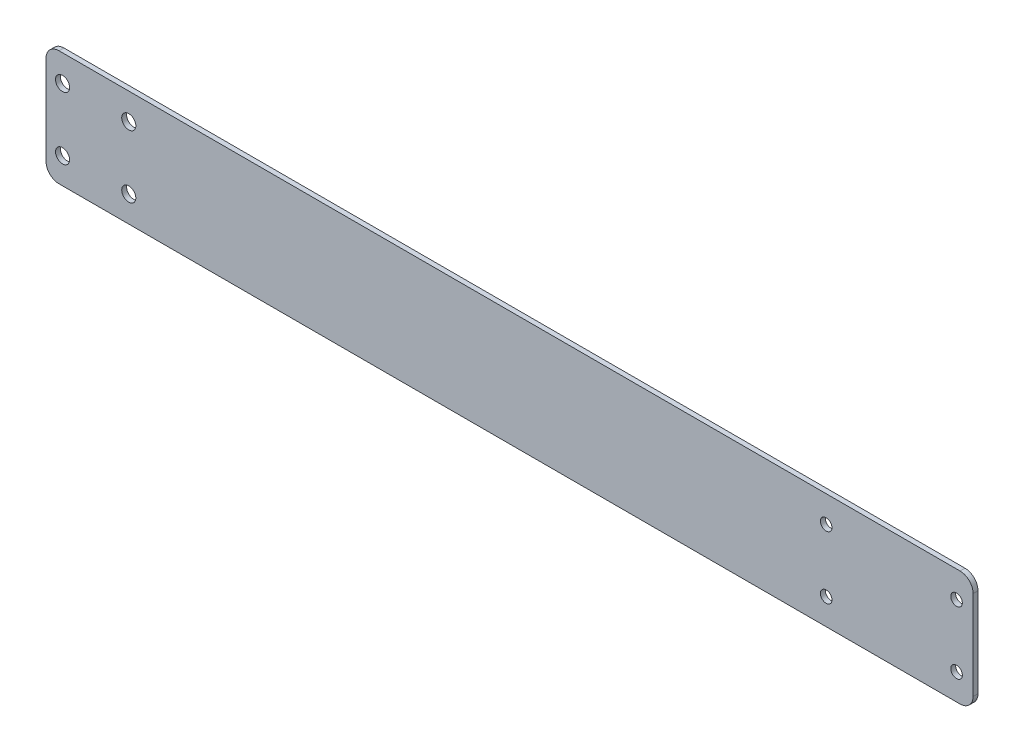
ISO-10303-21;
HEADER;
FILE_DESCRIPTION(('STEP AP214'),'2;1');
FILE_NAME('part.step','',(''),(''),'','','');
FILE_SCHEMA(('AUTOMOTIVE_DESIGN { 1 0 10303 214 1 1 1 1 }'));
ENDSEC;
DATA;
#1=APPLICATION_CONTEXT('core data for automotive mechanical design processes');
#2=APPLICATION_PROTOCOL_DEFINITION('international standard','automotive_design',2000,#1);
#3=PRODUCT_CONTEXT('',#1,'mechanical');
#4=PRODUCT('Part','Part','',(#3));
#5=PRODUCT_RELATED_PRODUCT_CATEGORY('part','',(#4));
#6=PRODUCT_DEFINITION_FORMATION('','',#4);
#7=PRODUCT_DEFINITION_CONTEXT('part definition',#1,'design');
#8=PRODUCT_DEFINITION('design','',#6,#7);
#9=PRODUCT_DEFINITION_SHAPE('','',#8);
#10=(LENGTH_UNIT() NAMED_UNIT(*) SI_UNIT(.MILLI.,.METRE.));
#11=(NAMED_UNIT(*) PLANE_ANGLE_UNIT() SI_UNIT($,.RADIAN.));
#12=(NAMED_UNIT(*) SI_UNIT($,.STERADIAN.) SOLID_ANGLE_UNIT());
#13=UNCERTAINTY_MEASURE_WITH_UNIT(LENGTH_MEASURE(1.E-05),#10,'distance_accuracy_value','');
#14=(GEOMETRIC_REPRESENTATION_CONTEXT(3) GLOBAL_UNCERTAINTY_ASSIGNED_CONTEXT((#13)) GLOBAL_UNIT_ASSIGNED_CONTEXT((#10,
#11,#12)) REPRESENTATION_CONTEXT('',''));
#15=CARTESIAN_POINT('',(0.,0.,0.));
#16=DIRECTION('',(0.,0.,1.));
#17=DIRECTION('',(1.,0.,0.));
#18=AXIS2_PLACEMENT_3D('',#15,#16,#17);
#19=CARTESIAN_POINT('',(0.,0.,-1.8796));
#20=DIRECTION('',(-1.,0.,0.));
#21=DIRECTION('',(0.,0.,1.));
#22=AXIS2_PLACEMENT_3D('',#19,#20,#21);
#23=PLANE('',#22);
#24=DIRECTION('',(0.,-1.,0.));
#25=VECTOR('',#24,1.);
#26=CARTESIAN_POINT('',(0.,0.,-1.8796));
#27=LINE('',#26,#25);
#28=CARTESIAN_POINT('',(0.,39.196,-1.8796));
#29=VERTEX_POINT('',#28);
#30=CARTESIAN_POINT('',(0.,5.,-1.8796));
#31=VERTEX_POINT('',#30);
#32=EDGE_CURVE('E170',#29,#31,#27,.T.);
#33=ORIENTED_EDGE('',*,*,#32,.T.);
#34=DIRECTION('',(0.,0.,1.));
#35=VECTOR('',#34,1.);
#36=CARTESIAN_POINT('',(0.,5.,-1.8796));
#37=LINE('',#36,#35);
#38=CARTESIAN_POINT('',(0.,5.,0.));
#39=VERTEX_POINT('',#38);
#40=EDGE_CURVE('E129',#31,#39,#37,.T.);
#41=ORIENTED_EDGE('',*,*,#40,.T.);
#42=DIRECTION('',(0.,-1.,0.));
#43=VECTOR('',#42,1.);
#44=CARTESIAN_POINT('',(0.,0.,0.));
#45=LINE('',#44,#43);
#46=CARTESIAN_POINT('',(0.,39.196,0.));
#47=VERTEX_POINT('',#46);
#48=EDGE_CURVE('E113',#47,#39,#45,.T.);
#49=ORIENTED_EDGE('',*,*,#48,.F.);
#50=DIRECTION('',(0.,0.,1.));
#51=VECTOR('',#50,1.);
#52=CARTESIAN_POINT('',(0.,39.196,-1.8796));
#53=LINE('',#52,#51);
#54=EDGE_CURVE('E126',#47,#29,#53,.F.);
#55=ORIENTED_EDGE('',*,*,#54,.T.);
#56=EDGE_LOOP('',(#33,#41,#49,#55));
#57=FACE_BOUND('',#56,.T.);
#58=ADVANCED_FACE('F45',(#57),#23,.T.);
#59=CARTESIAN_POINT('',(0.,44.196,-1.8796));
#60=DIRECTION('',(0.,1.,0.));
#61=DIRECTION('',(0.,0.,1.));
#62=AXIS2_PLACEMENT_3D('',#59,#60,#61);
#63=PLANE('',#62);
#64=DIRECTION('',(-1.,0.,0.));
#65=VECTOR('',#64,1.);
#66=CARTESIAN_POINT('',(0.,44.196,-1.8796));
#67=LINE('',#66,#65);
#68=CARTESIAN_POINT('',(350.6,44.196,-1.8796));
#69=VERTEX_POINT('',#68);
#70=CARTESIAN_POINT('',(5.,44.196,-1.8796));
#71=VERTEX_POINT('',#70);
#72=EDGE_CURVE('E136',#69,#71,#67,.T.);
#73=ORIENTED_EDGE('',*,*,#72,.T.);
#74=DIRECTION('',(0.,0.,1.));
#75=VECTOR('',#74,1.);
#76=CARTESIAN_POINT('',(5.,44.196,-1.8796));
#77=LINE('',#76,#75);
#78=CARTESIAN_POINT('',(5.,44.196,0.));
#79=VERTEX_POINT('',#78);
#80=EDGE_CURVE('E162',#71,#79,#77,.T.);
#81=ORIENTED_EDGE('',*,*,#80,.T.);
#82=DIRECTION('',(-1.,0.,0.));
#83=VECTOR('',#82,1.);
#84=CARTESIAN_POINT('',(0.,44.196,0.));
#85=LINE('',#84,#83);
#86=CARTESIAN_POINT('',(350.6,44.196,0.));
#87=VERTEX_POINT('',#86);
#88=EDGE_CURVE('E115',#87,#79,#85,.T.);
#89=ORIENTED_EDGE('',*,*,#88,.F.);
#90=DIRECTION('',(0.,0.,1.));
#91=VECTOR('',#90,1.);
#92=CARTESIAN_POINT('',(350.6,44.196,-1.8796));
#93=LINE('',#92,#91);
#94=EDGE_CURVE('E160',#87,#69,#93,.F.);
#95=ORIENTED_EDGE('',*,*,#94,.T.);
#96=EDGE_LOOP('',(#73,#81,#89,#95));
#97=FACE_BOUND('',#96,.T.);
#98=ADVANCED_FACE('F268',(#97),#63,.T.);
#99=CARTESIAN_POINT('',(355.6,0.,-1.8796));
#100=DIRECTION('',(1.,0.,0.));
#101=DIRECTION('',(0.,0.,-1.));
#102=AXIS2_PLACEMENT_3D('',#99,#100,#101);
#103=PLANE('',#102);
#104=DIRECTION('',(0.,1.,0.));
#105=VECTOR('',#104,1.);
#106=CARTESIAN_POINT('',(355.6,0.,0.));
#107=LINE('',#106,#105);
#108=CARTESIAN_POINT('',(355.6,5.,0.));
#109=VERTEX_POINT('',#108);
#110=CARTESIAN_POINT('',(355.6,39.196,0.));
#111=VERTEX_POINT('',#110);
#112=EDGE_CURVE('E167',#109,#111,#107,.T.);
#113=ORIENTED_EDGE('',*,*,#112,.F.);
#114=DIRECTION('',(0.,0.,1.));
#115=VECTOR('',#114,1.);
#116=CARTESIAN_POINT('',(355.6,5.,-1.8796));
#117=LINE('',#116,#115);
#118=CARTESIAN_POINT('',(355.6,5.,-1.8796));
#119=VERTEX_POINT('',#118);
#120=EDGE_CURVE('E11',#109,#119,#117,.F.);
#121=ORIENTED_EDGE('',*,*,#120,.T.);
#122=DIRECTION('',(0.,1.,0.));
#123=VECTOR('',#122,1.);
#124=CARTESIAN_POINT('',(355.6,0.,-1.8796));
#125=LINE('',#124,#123);
#126=CARTESIAN_POINT('',(355.6,39.196,-1.8796));
#127=VERTEX_POINT('',#126);
#128=EDGE_CURVE('E141',#119,#127,#125,.T.);
#129=ORIENTED_EDGE('',*,*,#128,.T.);
#130=DIRECTION('',(0.,0.,1.));
#131=VECTOR('',#130,1.);
#132=CARTESIAN_POINT('',(355.6,39.196,-1.8796));
#133=LINE('',#132,#131);
#134=EDGE_CURVE('E53',#127,#111,#133,.T.);
#135=ORIENTED_EDGE('',*,*,#134,.T.);
#136=EDGE_LOOP('',(#113,#121,#129,#135));
#137=FACE_BOUND('',#136,.T.);
#138=ADVANCED_FACE('F166',(#137),#103,.T.);
#139=CARTESIAN_POINT('',(0.,0.,-1.8796));
#140=DIRECTION('',(0.,-1.,0.));
#141=DIRECTION('',(0.,0.,-1.));
#142=AXIS2_PLACEMENT_3D('',#139,#140,#141);
#143=PLANE('',#142);
#144=DIRECTION('',(1.,0.,0.));
#145=VECTOR('',#144,1.);
#146=CARTESIAN_POINT('',(0.,0.,0.));
#147=LINE('',#146,#145);
#148=CARTESIAN_POINT('',(5.,0.,0.));
#149=VERTEX_POINT('',#148);
#150=CARTESIAN_POINT('',(350.6,0.,0.));
#151=VERTEX_POINT('',#150);
#152=EDGE_CURVE('E130',#149,#151,#147,.T.);
#153=ORIENTED_EDGE('',*,*,#152,.F.);
#154=DIRECTION('',(0.,0.,1.));
#155=VECTOR('',#154,1.);
#156=CARTESIAN_POINT('',(5.,0.,-1.8796));
#157=LINE('',#156,#155);
#158=CARTESIAN_POINT('',(5.,0.,-1.8796));
#159=VERTEX_POINT('',#158);
#160=EDGE_CURVE('E152',#149,#159,#157,.F.);
#161=ORIENTED_EDGE('',*,*,#160,.T.);
#162=DIRECTION('',(1.,0.,0.));
#163=VECTOR('',#162,1.);
#164=CARTESIAN_POINT('',(0.,0.,-1.8796));
#165=LINE('',#164,#163);
#166=CARTESIAN_POINT('',(350.6,0.,-1.8796));
#167=VERTEX_POINT('',#166);
#168=EDGE_CURVE('E174',#159,#167,#165,.T.);
#169=ORIENTED_EDGE('',*,*,#168,.T.);
#170=DIRECTION('',(0.,0.,1.));
#171=VECTOR('',#170,1.);
#172=CARTESIAN_POINT('',(350.6,0.,-1.8796));
#173=LINE('',#172,#171);
#174=EDGE_CURVE('E149',#167,#151,#173,.T.);
#175=ORIENTED_EDGE('',*,*,#174,.T.);
#176=EDGE_LOOP('',(#153,#161,#169,#175));
#177=FACE_BOUND('',#176,.T.);
#178=ADVANCED_FACE('F277',(#177),#143,.T.);
#179=CARTESIAN_POINT('',(0.,0.,-1.8796));
#180=DIRECTION('',(0.,0.,-1.));
#181=DIRECTION('',(-1.,0.,0.));
#182=AXIS2_PLACEMENT_3D('',#179,#180,#181);
#183=PLANE('',#182);
#184=CARTESIAN_POINT('',(31.75,9.99999999999997,-1.8796));
#185=DIRECTION('',(0.,0.,1.));
#186=DIRECTION('',(1.,0.,0.));
#187=AXIS2_PLACEMENT_3D('',#184,#185,#186);
#188=CIRCLE('',#187,2.7051);
#189=CARTESIAN_POINT('',(34.4551,9.99999999999997,-1.8796));
#190=VERTEX_POINT('',#189);
#191=EDGE_CURVE('E217',#190,#190,#188,.T.);
#192=ORIENTED_EDGE('',*,*,#191,.T.);
#193=EDGE_LOOP('',(#192));
#194=FACE_BOUND('',#193,.T.);
#195=CARTESIAN_POINT('',(6.35000000000003,9.99999999999996,-1.8796));
#196=DIRECTION('',(0.,0.,1.));
#197=DIRECTION('',(1.,0.,0.));
#198=AXIS2_PLACEMENT_3D('',#195,#196,#197);
#199=CIRCLE('',#198,2.7051);
#200=CARTESIAN_POINT('',(9.05510000000003,9.99999999999996,-1.8796));
#201=VERTEX_POINT('',#200);
#202=EDGE_CURVE('E211',#201,#201,#199,.T.);
#203=ORIENTED_EDGE('',*,*,#202,.T.);
#204=EDGE_LOOP('',(#203));
#205=FACE_BOUND('',#204,.T.);
#206=CARTESIAN_POINT('',(31.75,34.,-1.8796));
#207=DIRECTION('',(0.,0.,1.));
#208=DIRECTION('',(1.,0.,0.));
#209=AXIS2_PLACEMENT_3D('',#206,#207,#208);
#210=CIRCLE('',#209,2.7051);
#211=CARTESIAN_POINT('',(34.4551,34.,-1.8796));
#212=VERTEX_POINT('',#211);
#213=EDGE_CURVE('E205',#212,#212,#210,.T.);
#214=ORIENTED_EDGE('',*,*,#213,.T.);
#215=EDGE_LOOP('',(#214));
#216=FACE_BOUND('',#215,.T.);
#217=CARTESIAN_POINT('',(6.35000000000002,34.,-1.8796));
#218=DIRECTION('',(0.,0.,1.));
#219=DIRECTION('',(1.,0.,0.));
#220=AXIS2_PLACEMENT_3D('',#217,#218,#219);
#221=CIRCLE('',#220,2.7051);
#222=CARTESIAN_POINT('',(9.05510000000002,34.,-1.8796));
#223=VERTEX_POINT('',#222);
#224=EDGE_CURVE('E199',#223,#223,#221,.T.);
#225=ORIENTED_EDGE('',*,*,#224,.T.);
#226=EDGE_LOOP('',(#225));
#227=FACE_BOUND('',#226,.T.);
#228=CARTESIAN_POINT('',(299.25,34.,-1.8796));
#229=DIRECTION('',(0.,0.,1.));
#230=DIRECTION('',(1.,0.,0.));
#231=AXIS2_PLACEMENT_3D('',#228,#229,#230);
#232=CIRCLE('',#231,2.2225);
#233=CARTESIAN_POINT('',(301.4725,34.,-1.8796));
#234=VERTEX_POINT('',#233);
#235=EDGE_CURVE('E193',#234,#234,#232,.T.);
#236=ORIENTED_EDGE('',*,*,#235,.T.);
#237=EDGE_LOOP('',(#236));
#238=FACE_BOUND('',#237,.T.);
#239=CARTESIAN_POINT('',(349.25,34.,-1.8796));
#240=DIRECTION('',(0.,0.,1.));
#241=DIRECTION('',(1.,0.,0.));
#242=AXIS2_PLACEMENT_3D('',#239,#240,#241);
#243=CIRCLE('',#242,2.2225);
#244=CARTESIAN_POINT('',(351.4725,34.,-1.8796));
#245=VERTEX_POINT('',#244);
#246=EDGE_CURVE('E187',#245,#245,#243,.T.);
#247=ORIENTED_EDGE('',*,*,#246,.T.);
#248=EDGE_LOOP('',(#247));
#249=FACE_BOUND('',#248,.T.);
#250=CARTESIAN_POINT('',(349.25,10.,-1.8796));
#251=DIRECTION('',(0.,0.,1.));
#252=DIRECTION('',(1.,0.,0.));
#253=AXIS2_PLACEMENT_3D('',#250,#251,#252);
#254=CIRCLE('',#253,2.2225);
#255=CARTESIAN_POINT('',(351.4725,10.,-1.8796));
#256=VERTEX_POINT('',#255);
#257=EDGE_CURVE('E181',#256,#256,#254,.T.);
#258=ORIENTED_EDGE('',*,*,#257,.T.);
#259=EDGE_LOOP('',(#258));
#260=FACE_BOUND('',#259,.T.);
#261=CARTESIAN_POINT('',(299.25,10.,-1.8796));
#262=DIRECTION('',(0.,0.,1.));
#263=DIRECTION('',(1.,0.,0.));
#264=AXIS2_PLACEMENT_3D('',#261,#262,#263);
#265=CIRCLE('',#264,2.2225);
#266=CARTESIAN_POINT('',(301.4725,10.,-1.8796));
#267=VERTEX_POINT('',#266);
#268=EDGE_CURVE('E131',#267,#267,#265,.T.);
#269=ORIENTED_EDGE('',*,*,#268,.T.);
#270=EDGE_LOOP('',(#269));
#271=FACE_BOUND('',#270,.T.);
#272=ORIENTED_EDGE('',*,*,#168,.F.);
#273=CARTESIAN_POINT('',(5.,5.,-1.8796));
#274=DIRECTION('',(0.,0.,-1.));
#275=DIRECTION('',(-1.,0.,0.));
#276=AXIS2_PLACEMENT_3D('',#273,#274,#275);
#277=CIRCLE('',#276,5.);
#278=EDGE_CURVE('E158',#159,#31,#277,.T.);
#279=ORIENTED_EDGE('',*,*,#278,.T.);
#280=ORIENTED_EDGE('',*,*,#32,.F.);
#281=CARTESIAN_POINT('',(5.,39.196,-1.8796));
#282=DIRECTION('',(0.,0.,-1.));
#283=DIRECTION('',(-1.,0.,0.));
#284=AXIS2_PLACEMENT_3D('',#281,#282,#283);
#285=CIRCLE('',#284,5.);
#286=EDGE_CURVE('E135',#29,#71,#285,.T.);
#287=ORIENTED_EDGE('',*,*,#286,.T.);
#288=ORIENTED_EDGE('',*,*,#72,.F.);
#289=CARTESIAN_POINT('',(350.6,39.196,-1.8796));
#290=DIRECTION('',(0.,0.,-1.));
#291=DIRECTION('',(-1.,0.,0.));
#292=AXIS2_PLACEMENT_3D('',#289,#290,#291);
#293=CIRCLE('',#292,5.);
#294=EDGE_CURVE('E60',#69,#127,#293,.T.);
#295=ORIENTED_EDGE('',*,*,#294,.T.);
#296=ORIENTED_EDGE('',*,*,#128,.F.);
#297=CARTESIAN_POINT('',(350.6,5.,-1.8796));
#298=DIRECTION('',(0.,0.,-1.));
#299=DIRECTION('',(-1.,0.,0.));
#300=AXIS2_PLACEMENT_3D('',#297,#298,#299);
#301=CIRCLE('',#300,5.);
#302=EDGE_CURVE('E155',#119,#167,#301,.T.);
#303=ORIENTED_EDGE('',*,*,#302,.T.);
#304=EDGE_LOOP('',(#272,#279,#280,#287,#288,#295,#296,#303));
#305=FACE_BOUND('',#304,.T.);
#306=ADVANCED_FACE('F226',(#194,#205,#216,#227,#238,#249,#260,#271,#305),#183,.T.);
#307=CARTESIAN_POINT('',(0.,0.,0.));
#308=DIRECTION('',(0.,0.,-1.));
#309=DIRECTION('',(-1.,0.,0.));
#310=AXIS2_PLACEMENT_3D('',#307,#308,#309);
#311=PLANE('',#310);
#312=CARTESIAN_POINT('',(31.75,9.99999999999997,0.));
#313=DIRECTION('',(0.,0.,1.));
#314=DIRECTION('',(1.,0.,0.));
#315=AXIS2_PLACEMENT_3D('',#312,#313,#314);
#316=CIRCLE('',#315,2.7051);
#317=CARTESIAN_POINT('',(34.4551,9.99999999999997,0.));
#318=VERTEX_POINT('',#317);
#319=EDGE_CURVE('E220',#318,#318,#316,.T.);
#320=ORIENTED_EDGE('',*,*,#319,.F.);
#321=EDGE_LOOP('',(#320));
#322=FACE_BOUND('',#321,.T.);
#323=CARTESIAN_POINT('',(6.35000000000003,9.99999999999996,0.));
#324=DIRECTION('',(0.,0.,1.));
#325=DIRECTION('',(1.,0.,0.));
#326=AXIS2_PLACEMENT_3D('',#323,#324,#325);
#327=CIRCLE('',#326,2.7051);
#328=CARTESIAN_POINT('',(9.05510000000003,9.99999999999996,0.));
#329=VERTEX_POINT('',#328);
#330=EDGE_CURVE('E214',#329,#329,#327,.T.);
#331=ORIENTED_EDGE('',*,*,#330,.F.);
#332=EDGE_LOOP('',(#331));
#333=FACE_BOUND('',#332,.T.);
#334=CARTESIAN_POINT('',(31.75,34.,0.));
#335=DIRECTION('',(0.,0.,1.));
#336=DIRECTION('',(1.,0.,0.));
#337=AXIS2_PLACEMENT_3D('',#334,#335,#336);
#338=CIRCLE('',#337,2.7051);
#339=CARTESIAN_POINT('',(34.4551,34.,0.));
#340=VERTEX_POINT('',#339);
#341=EDGE_CURVE('E208',#340,#340,#338,.T.);
#342=ORIENTED_EDGE('',*,*,#341,.F.);
#343=EDGE_LOOP('',(#342));
#344=FACE_BOUND('',#343,.T.);
#345=CARTESIAN_POINT('',(6.35000000000002,34.,0.));
#346=DIRECTION('',(0.,0.,1.));
#347=DIRECTION('',(1.,0.,0.));
#348=AXIS2_PLACEMENT_3D('',#345,#346,#347);
#349=CIRCLE('',#348,2.7051);
#350=CARTESIAN_POINT('',(9.05510000000002,34.,0.));
#351=VERTEX_POINT('',#350);
#352=EDGE_CURVE('E202',#351,#351,#349,.T.);
#353=ORIENTED_EDGE('',*,*,#352,.F.);
#354=EDGE_LOOP('',(#353));
#355=FACE_BOUND('',#354,.T.);
#356=CARTESIAN_POINT('',(299.25,34.,0.));
#357=DIRECTION('',(0.,0.,1.));
#358=DIRECTION('',(1.,0.,0.));
#359=AXIS2_PLACEMENT_3D('',#356,#357,#358);
#360=CIRCLE('',#359,2.2225);
#361=CARTESIAN_POINT('',(301.4725,34.,0.));
#362=VERTEX_POINT('',#361);
#363=EDGE_CURVE('E196',#362,#362,#360,.T.);
#364=ORIENTED_EDGE('',*,*,#363,.F.);
#365=EDGE_LOOP('',(#364));
#366=FACE_BOUND('',#365,.T.);
#367=CARTESIAN_POINT('',(349.25,34.,0.));
#368=DIRECTION('',(0.,0.,1.));
#369=DIRECTION('',(1.,0.,0.));
#370=AXIS2_PLACEMENT_3D('',#367,#368,#369);
#371=CIRCLE('',#370,2.2225);
#372=CARTESIAN_POINT('',(351.4725,34.,0.));
#373=VERTEX_POINT('',#372);
#374=EDGE_CURVE('E190',#373,#373,#371,.T.);
#375=ORIENTED_EDGE('',*,*,#374,.F.);
#376=EDGE_LOOP('',(#375));
#377=FACE_BOUND('',#376,.T.);
#378=CARTESIAN_POINT('',(349.25,10.,0.));
#379=DIRECTION('',(0.,0.,1.));
#380=DIRECTION('',(1.,0.,0.));
#381=AXIS2_PLACEMENT_3D('',#378,#379,#380);
#382=CIRCLE('',#381,2.2225);
#383=CARTESIAN_POINT('',(351.4725,10.,0.));
#384=VERTEX_POINT('',#383);
#385=EDGE_CURVE('E184',#384,#384,#382,.T.);
#386=ORIENTED_EDGE('',*,*,#385,.F.);
#387=EDGE_LOOP('',(#386));
#388=FACE_BOUND('',#387,.T.);
#389=CARTESIAN_POINT('',(299.25,10.,0.));
#390=DIRECTION('',(0.,0.,1.));
#391=DIRECTION('',(1.,0.,0.));
#392=AXIS2_PLACEMENT_3D('',#389,#390,#391);
#393=CIRCLE('',#392,2.2225);
#394=CARTESIAN_POINT('',(301.4725,10.,0.));
#395=VERTEX_POINT('',#394);
#396=EDGE_CURVE('E178',#395,#395,#393,.T.);
#397=ORIENTED_EDGE('',*,*,#396,.F.);
#398=EDGE_LOOP('',(#397));
#399=FACE_BOUND('',#398,.T.);
#400=ORIENTED_EDGE('',*,*,#48,.T.);
#401=CARTESIAN_POINT('',(5.,5.,0.));
#402=DIRECTION('',(0.,0.,-1.));
#403=DIRECTION('',(-1.,0.,0.));
#404=AXIS2_PLACEMENT_3D('',#401,#402,#403);
#405=CIRCLE('',#404,5.);
#406=EDGE_CURVE('E120',#39,#149,#405,.F.);
#407=ORIENTED_EDGE('',*,*,#406,.T.);
#408=ORIENTED_EDGE('',*,*,#152,.T.);
#409=CARTESIAN_POINT('',(350.6,5.,0.));
#410=DIRECTION('',(0.,0.,-1.));
#411=DIRECTION('',(-1.,0.,0.));
#412=AXIS2_PLACEMENT_3D('',#409,#410,#411);
#413=CIRCLE('',#412,5.);
#414=EDGE_CURVE('E121',#151,#109,#413,.F.);
#415=ORIENTED_EDGE('',*,*,#414,.T.);
#416=ORIENTED_EDGE('',*,*,#112,.T.);
#417=CARTESIAN_POINT('',(350.6,39.196,0.));
#418=DIRECTION('',(0.,0.,-1.));
#419=DIRECTION('',(-1.,0.,0.));
#420=AXIS2_PLACEMENT_3D('',#417,#418,#419);
#421=CIRCLE('',#420,5.);
#422=EDGE_CURVE('E138',#111,#87,#421,.F.);
#423=ORIENTED_EDGE('',*,*,#422,.T.);
#424=ORIENTED_EDGE('',*,*,#88,.T.);
#425=CARTESIAN_POINT('',(5.,39.196,0.));
#426=DIRECTION('',(0.,0.,-1.));
#427=DIRECTION('',(-1.,0.,0.));
#428=AXIS2_PLACEMENT_3D('',#425,#426,#427);
#429=CIRCLE('',#428,5.);
#430=EDGE_CURVE('E110',#79,#47,#429,.F.);
#431=ORIENTED_EDGE('',*,*,#430,.T.);
#432=EDGE_LOOP('',(#400,#407,#408,#415,#416,#423,#424,#431));
#433=FACE_BOUND('',#432,.T.);
#434=ADVANCED_FACE('F112',(#322,#333,#344,#355,#366,#377,#388,#399,#433),#311,.F.);
#435=CARTESIAN_POINT('',(299.25,10.,-1.8796));
#436=DIRECTION('',(0.,0.,1.));
#437=DIRECTION('',(1.,0.,0.));
#438=AXIS2_PLACEMENT_3D('',#435,#436,#437);
#439=CYLINDRICAL_SURFACE('',#438,2.2225);
#440=ORIENTED_EDGE('',*,*,#268,.F.);
#441=EDGE_LOOP('',(#440));
#442=FACE_BOUND('',#441,.T.);
#443=ORIENTED_EDGE('',*,*,#396,.T.);
#444=EDGE_LOOP('',(#443));
#445=FACE_BOUND('',#444,.T.);
#446=ADVANCED_FACE('F239',(#442,#445),#439,.F.);
#447=CARTESIAN_POINT('',(349.25,10.,-1.8796));
#448=DIRECTION('',(0.,0.,1.));
#449=DIRECTION('',(1.,0.,0.));
#450=AXIS2_PLACEMENT_3D('',#447,#448,#449);
#451=CYLINDRICAL_SURFACE('',#450,2.2225);
#452=ORIENTED_EDGE('',*,*,#257,.F.);
#453=EDGE_LOOP('',(#452));
#454=FACE_BOUND('',#453,.T.);
#455=ORIENTED_EDGE('',*,*,#385,.T.);
#456=EDGE_LOOP('',(#455));
#457=FACE_BOUND('',#456,.T.);
#458=ADVANCED_FACE('F256',(#454,#457),#451,.F.);
#459=CARTESIAN_POINT('',(349.25,34.,-1.8796));
#460=DIRECTION('',(0.,0.,1.));
#461=DIRECTION('',(1.,0.,0.));
#462=AXIS2_PLACEMENT_3D('',#459,#460,#461);
#463=CYLINDRICAL_SURFACE('',#462,2.2225);
#464=ORIENTED_EDGE('',*,*,#246,.F.);
#465=EDGE_LOOP('',(#464));
#466=FACE_BOUND('',#465,.T.);
#467=ORIENTED_EDGE('',*,*,#374,.T.);
#468=EDGE_LOOP('',(#467));
#469=FACE_BOUND('',#468,.T.);
#470=ADVANCED_FACE('F262',(#466,#469),#463,.F.);
#471=CARTESIAN_POINT('',(299.25,34.,-1.8796));
#472=DIRECTION('',(0.,0.,1.));
#473=DIRECTION('',(1.,0.,0.));
#474=AXIS2_PLACEMENT_3D('',#471,#472,#473);
#475=CYLINDRICAL_SURFACE('',#474,2.2225);
#476=ORIENTED_EDGE('',*,*,#235,.F.);
#477=EDGE_LOOP('',(#476));
#478=FACE_BOUND('',#477,.T.);
#479=ORIENTED_EDGE('',*,*,#363,.T.);
#480=EDGE_LOOP('',(#479));
#481=FACE_BOUND('',#480,.T.);
#482=ADVANCED_FACE('F353',(#478,#481),#475,.F.);
#483=CARTESIAN_POINT('',(6.35000000000002,34.,-1.8796));
#484=DIRECTION('',(0.,0.,1.));
#485=DIRECTION('',(1.,0.,0.));
#486=AXIS2_PLACEMENT_3D('',#483,#484,#485);
#487=CYLINDRICAL_SURFACE('',#486,2.7051);
#488=ORIENTED_EDGE('',*,*,#224,.F.);
#489=EDGE_LOOP('',(#488));
#490=FACE_BOUND('',#489,.T.);
#491=ORIENTED_EDGE('',*,*,#352,.T.);
#492=EDGE_LOOP('',(#491));
#493=FACE_BOUND('',#492,.T.);
#494=ADVANCED_FACE('F342',(#490,#493),#487,.F.);
#495=CARTESIAN_POINT('',(31.75,34.,-1.8796));
#496=DIRECTION('',(0.,0.,1.));
#497=DIRECTION('',(1.,0.,0.));
#498=AXIS2_PLACEMENT_3D('',#495,#496,#497);
#499=CYLINDRICAL_SURFACE('',#498,2.7051);
#500=ORIENTED_EDGE('',*,*,#213,.F.);
#501=EDGE_LOOP('',(#500));
#502=FACE_BOUND('',#501,.T.);
#503=ORIENTED_EDGE('',*,*,#341,.T.);
#504=EDGE_LOOP('',(#503));
#505=FACE_BOUND('',#504,.T.);
#506=ADVANCED_FACE('F331',(#502,#505),#499,.F.);
#507=CARTESIAN_POINT('',(6.35000000000003,9.99999999999996,-1.8796));
#508=DIRECTION('',(0.,0.,1.));
#509=DIRECTION('',(1.,0.,0.));
#510=AXIS2_PLACEMENT_3D('',#507,#508,#509);
#511=CYLINDRICAL_SURFACE('',#510,2.7051);
#512=ORIENTED_EDGE('',*,*,#202,.F.);
#513=EDGE_LOOP('',(#512));
#514=FACE_BOUND('',#513,.T.);
#515=ORIENTED_EDGE('',*,*,#330,.T.);
#516=EDGE_LOOP('',(#515));
#517=FACE_BOUND('',#516,.T.);
#518=ADVANCED_FACE('F233',(#514,#517),#511,.F.);
#519=CARTESIAN_POINT('',(31.75,9.99999999999997,-1.8796));
#520=DIRECTION('',(0.,0.,1.));
#521=DIRECTION('',(1.,0.,0.));
#522=AXIS2_PLACEMENT_3D('',#519,#520,#521);
#523=CYLINDRICAL_SURFACE('',#522,2.7051);
#524=ORIENTED_EDGE('',*,*,#191,.F.);
#525=EDGE_LOOP('',(#524));
#526=FACE_BOUND('',#525,.T.);
#527=ORIENTED_EDGE('',*,*,#319,.T.);
#528=EDGE_LOOP('',(#527));
#529=FACE_BOUND('',#528,.T.);
#530=ADVANCED_FACE('F229',(#526,#529),#523,.F.);
#531=CARTESIAN_POINT('',(5.,5.,-1.8796));
#532=DIRECTION('',(0.,0.,1.));
#533=DIRECTION('',(1.,0.,0.));
#534=AXIS2_PLACEMENT_3D('',#531,#532,#533);
#535=CYLINDRICAL_SURFACE('',#534,5.);
#536=ORIENTED_EDGE('',*,*,#278,.F.);
#537=ORIENTED_EDGE('',*,*,#160,.F.);
#538=ORIENTED_EDGE('',*,*,#406,.F.);
#539=ORIENTED_EDGE('',*,*,#40,.F.);
#540=EDGE_LOOP('',(#536,#537,#538,#539));
#541=FACE_BOUND('',#540,.T.);
#542=ADVANCED_FACE('F232',(#541),#535,.T.);
#543=CARTESIAN_POINT('',(5.,39.196,-1.8796));
#544=DIRECTION('',(0.,0.,1.));
#545=DIRECTION('',(1.,0.,0.));
#546=AXIS2_PLACEMENT_3D('',#543,#544,#545);
#547=CYLINDRICAL_SURFACE('',#546,5.);
#548=ORIENTED_EDGE('',*,*,#286,.F.);
#549=ORIENTED_EDGE('',*,*,#54,.F.);
#550=ORIENTED_EDGE('',*,*,#430,.F.);
#551=ORIENTED_EDGE('',*,*,#80,.F.);
#552=EDGE_LOOP('',(#548,#549,#550,#551));
#553=FACE_BOUND('',#552,.T.);
#554=ADVANCED_FACE('F134',(#553),#547,.T.);
#555=CARTESIAN_POINT('',(350.6,5.,-1.8796));
#556=DIRECTION('',(0.,0.,1.));
#557=DIRECTION('',(1.,0.,0.));
#558=AXIS2_PLACEMENT_3D('',#555,#556,#557);
#559=CYLINDRICAL_SURFACE('',#558,5.);
#560=ORIENTED_EDGE('',*,*,#302,.F.);
#561=ORIENTED_EDGE('',*,*,#120,.F.);
#562=ORIENTED_EDGE('',*,*,#414,.F.);
#563=ORIENTED_EDGE('',*,*,#174,.F.);
#564=EDGE_LOOP('',(#560,#561,#562,#563));
#565=FACE_BOUND('',#564,.T.);
#566=ADVANCED_FACE('F283',(#565),#559,.T.);
#567=CARTESIAN_POINT('',(350.6,39.196,-1.8796));
#568=DIRECTION('',(0.,0.,1.));
#569=DIRECTION('',(1.,0.,0.));
#570=AXIS2_PLACEMENT_3D('',#567,#568,#569);
#571=CYLINDRICAL_SURFACE('',#570,5.);
#572=ORIENTED_EDGE('',*,*,#294,.F.);
#573=ORIENTED_EDGE('',*,*,#94,.F.);
#574=ORIENTED_EDGE('',*,*,#422,.F.);
#575=ORIENTED_EDGE('',*,*,#134,.F.);
#576=EDGE_LOOP('',(#572,#573,#574,#575));
#577=FACE_BOUND('',#576,.T.);
#578=ADVANCED_FACE('F47',(#577),#571,.T.);
#579=CLOSED_SHELL('',(#58,#98,#138,#178,#306,#434,#446,#458,#470,#482,#494,#506,#518,#530,#542,
#554,#566,#578));
#580=MANIFOLD_SOLID_BREP('B2',#579);
#581=ADVANCED_BREP_SHAPE_REPRESENTATION('',(#18,#580),#14);
#582=SHAPE_DEFINITION_REPRESENTATION(#9,#581);
ENDSEC;
END-ISO-10303-21;
